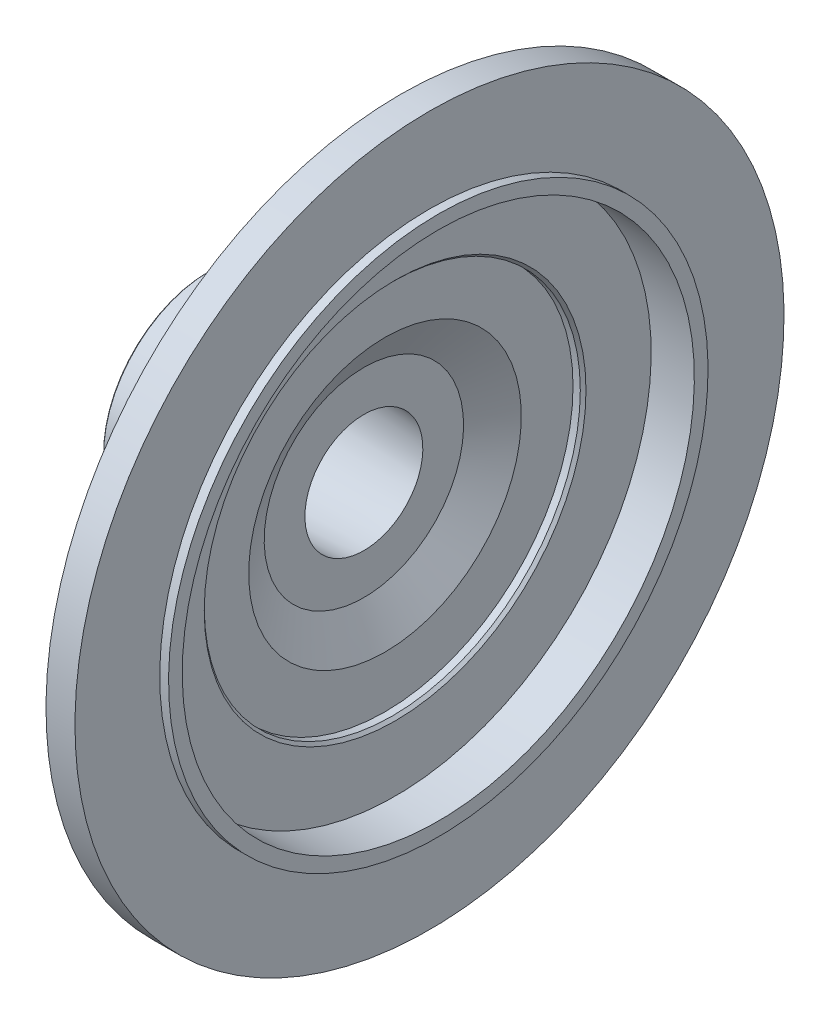
ISO-10303-21;
HEADER;
FILE_DESCRIPTION(('STEP AP214'),'2;1');
FILE_NAME('part.step','',(''),(''),'','','');
FILE_SCHEMA(('AUTOMOTIVE_DESIGN { 1 0 10303 214 1 1 1 1 }'));
ENDSEC;
DATA;
#1=APPLICATION_CONTEXT('core data for automotive mechanical design processes');
#2=APPLICATION_PROTOCOL_DEFINITION('international standard','automotive_design',2000,#1);
#3=PRODUCT_CONTEXT('',#1,'mechanical');
#4=PRODUCT('Part','Part','',(#3));
#5=PRODUCT_RELATED_PRODUCT_CATEGORY('part','',(#4));
#6=PRODUCT_DEFINITION_FORMATION('','',#4);
#7=PRODUCT_DEFINITION_CONTEXT('part definition',#1,'design');
#8=PRODUCT_DEFINITION('design','',#6,#7);
#9=PRODUCT_DEFINITION_SHAPE('','',#8);
#10=(LENGTH_UNIT() NAMED_UNIT(*) SI_UNIT(.MILLI.,.METRE.));
#11=(NAMED_UNIT(*) PLANE_ANGLE_UNIT() SI_UNIT($,.RADIAN.));
#12=(NAMED_UNIT(*) SI_UNIT($,.STERADIAN.) SOLID_ANGLE_UNIT());
#13=UNCERTAINTY_MEASURE_WITH_UNIT(LENGTH_MEASURE(1.E-05),#10,'distance_accuracy_value','');
#14=(GEOMETRIC_REPRESENTATION_CONTEXT(3) GLOBAL_UNCERTAINTY_ASSIGNED_CONTEXT((#13)) GLOBAL_UNIT_ASSIGNED_CONTEXT((#10,
#11,#12)) REPRESENTATION_CONTEXT('',''));
#15=CARTESIAN_POINT('',(0.,0.,0.));
#16=DIRECTION('',(0.,0.,1.));
#17=DIRECTION('',(1.,0.,0.));
#18=AXIS2_PLACEMENT_3D('',#15,#16,#17);
#19=CARTESIAN_POINT('',(-48.0675954825534,0.,0.));
#20=DIRECTION('',(1.,0.,0.));
#21=DIRECTION('',(0.,1.,0.));
#22=AXIS2_PLACEMENT_3D('',#19,#20,#21);
#23=TOROIDAL_SURFACE('',#22,42.45,4.99999999999999);
#24=CARTESIAN_POINT('',(-48.0675954825534,0.,0.));
#25=DIRECTION('',(1.,0.,0.));
#26=DIRECTION('',(0.,1.,0.));
#27=AXIS2_PLACEMENT_3D('',#24,#25,#26);
#28=CIRCLE('',#27,37.45);
#29=CARTESIAN_POINT('',(-48.0675954825534,37.45,0.));
#30=VERTEX_POINT('',#29);
#31=EDGE_CURVE('E109',#30,#30,#28,.T.);
#32=ORIENTED_EDGE('',*,*,#31,.T.);
#33=EDGE_LOOP('',(#32));
#34=FACE_BOUND('',#33,.T.);
#35=CARTESIAN_POINT('',(-43.0675954825534,0.,0.));
#36=DIRECTION('',(1.,0.,0.));
#37=DIRECTION('',(0.,1.,0.));
#38=AXIS2_PLACEMENT_3D('',#35,#36,#37);
#39=CIRCLE('',#38,42.45);
#40=CARTESIAN_POINT('',(-43.0675954825534,42.45,0.));
#41=VERTEX_POINT('',#40);
#42=EDGE_CURVE('E10',#41,#41,#39,.T.);
#43=ORIENTED_EDGE('',*,*,#42,.F.);
#44=EDGE_LOOP('',(#43));
#45=FACE_BOUND('',#44,.T.);
#46=ADVANCED_FACE('F36',(#34,#45),#23,.F.);
#47=CARTESIAN_POINT('',(-43.0675954825534,42.45,0.));
#48=DIRECTION('',(-1.,0.,0.));
#49=DIRECTION('',(0.,-1.,0.));
#50=AXIS2_PLACEMENT_3D('',#47,#48,#49);
#51=PLANE('',#50);
#52=ORIENTED_EDGE('',*,*,#42,.T.);
#53=EDGE_LOOP('',(#52));
#54=FACE_BOUND('',#53,.T.);
#55=CARTESIAN_POINT('',(-43.0675954825534,0.,0.));
#56=DIRECTION('',(1.,0.,0.));
#57=DIRECTION('',(0.,1.,0.));
#58=AXIS2_PLACEMENT_3D('',#55,#56,#57);
#59=CIRCLE('',#58,68.6);
#60=CARTESIAN_POINT('',(-43.0675954825534,68.6,0.));
#61=VERTEX_POINT('',#60);
#62=EDGE_CURVE('E42',#61,#61,#59,.T.);
#63=ORIENTED_EDGE('',*,*,#62,.F.);
#64=EDGE_LOOP('',(#63));
#65=FACE_BOUND('',#64,.T.);
#66=ADVANCED_FACE('F127',(#54,#65),#51,.T.);
#67=CARTESIAN_POINT('',(0.,0.,0.));
#68=DIRECTION('',(1.,0.,0.));
#69=DIRECTION('',(0.,1.,0.));
#70=AXIS2_PLACEMENT_3D('',#67,#68,#69);
#71=CYLINDRICAL_SURFACE('',#70,68.6);
#72=ORIENTED_EDGE('',*,*,#62,.T.);
#73=EDGE_LOOP('',(#72));
#74=FACE_BOUND('',#73,.T.);
#75=CARTESIAN_POINT('',(-35.7675954825534,0.,0.));
#76=DIRECTION('',(1.,0.,0.));
#77=DIRECTION('',(0.,1.,0.));
#78=AXIS2_PLACEMENT_3D('',#75,#76,#77);
#79=CIRCLE('',#78,68.6);
#80=CARTESIAN_POINT('',(-35.7675954825534,68.6,0.));
#81=VERTEX_POINT('',#80);
#82=EDGE_CURVE('E46',#81,#81,#79,.T.);
#83=ORIENTED_EDGE('',*,*,#82,.F.);
#84=EDGE_LOOP('',(#83));
#85=FACE_BOUND('',#84,.T.);
#86=ADVANCED_FACE('F131',(#74,#85),#71,.T.);
#87=CARTESIAN_POINT('',(-35.7675954825534,68.6,0.));
#88=DIRECTION('',(-1.,0.,0.));
#89=DIRECTION('',(0.,-1.,0.));
#90=AXIS2_PLACEMENT_3D('',#87,#88,#89);
#91=PLANE('',#90);
#92=ORIENTED_EDGE('',*,*,#82,.T.);
#93=EDGE_LOOP('',(#92));
#94=FACE_BOUND('',#93,.T.);
#95=CARTESIAN_POINT('',(-35.7675954825534,0.,0.));
#96=DIRECTION('',(1.,0.,0.));
#97=DIRECTION('',(0.,1.,0.));
#98=AXIS2_PLACEMENT_3D('',#95,#96,#97);
#99=CIRCLE('',#98,95.25);
#100=CARTESIAN_POINT('',(-35.7675954825534,95.25,0.));
#101=VERTEX_POINT('',#100);
#102=EDGE_CURVE('E50',#101,#101,#99,.T.);
#103=ORIENTED_EDGE('',*,*,#102,.F.);
#104=EDGE_LOOP('',(#103));
#105=FACE_BOUND('',#104,.T.);
#106=ADVANCED_FACE('F135',(#94,#105),#91,.T.);
#107=CARTESIAN_POINT('',(-25.9175954825534,0.,0.));
#108=DIRECTION('',(1.,0.,0.));
#109=DIRECTION('',(0.,1.,0.));
#110=AXIS2_PLACEMENT_3D('',#107,#108,#109);
#111=CONICAL_SURFACE('',#110,105.1,0.785398163397448);
#112=ORIENTED_EDGE('',*,*,#102,.T.);
#113=EDGE_LOOP('',(#112));
#114=FACE_BOUND('',#113,.T.);
#115=CARTESIAN_POINT('',(-25.9175954825534,0.,0.));
#116=DIRECTION('',(1.,0.,0.));
#117=DIRECTION('',(0.,1.,0.));
#118=AXIS2_PLACEMENT_3D('',#115,#116,#117);
#119=CIRCLE('',#118,105.1);
#120=CARTESIAN_POINT('',(-25.9175954825534,105.1,0.));
#121=VERTEX_POINT('',#120);
#122=EDGE_CURVE('E55',#121,#121,#119,.T.);
#123=ORIENTED_EDGE('',*,*,#122,.F.);
#124=EDGE_LOOP('',(#123));
#125=FACE_BOUND('',#124,.T.);
#126=ADVANCED_FACE('F141',(#114,#125),#111,.T.);
#127=CARTESIAN_POINT('',(0.,0.,0.));
#128=DIRECTION('',(1.,0.,0.));
#129=DIRECTION('',(0.,1.,0.));
#130=AXIS2_PLACEMENT_3D('',#127,#128,#129);
#131=CYLINDRICAL_SURFACE('',#130,105.1);
#132=ORIENTED_EDGE('',*,*,#122,.T.);
#133=EDGE_LOOP('',(#132));
#134=FACE_BOUND('',#133,.T.);
#135=CARTESIAN_POINT('',(-20.7675954825534,0.,0.));
#136=DIRECTION('',(1.,0.,0.));
#137=DIRECTION('',(0.,1.,0.));
#138=AXIS2_PLACEMENT_3D('',#135,#136,#137);
#139=CIRCLE('',#138,105.1);
#140=CARTESIAN_POINT('',(-20.7675954825534,105.1,0.));
#141=VERTEX_POINT('',#140);
#142=EDGE_CURVE('E58',#141,#141,#139,.T.);
#143=ORIENTED_EDGE('',*,*,#142,.F.);
#144=EDGE_LOOP('',(#143));
#145=FACE_BOUND('',#144,.T.);
#146=ADVANCED_FACE('F145',(#134,#145),#131,.T.);
#147=CARTESIAN_POINT('',(-20.7675954825534,105.1,0.));
#148=DIRECTION('',(-1.,0.,0.));
#149=DIRECTION('',(0.,-1.,0.));
#150=AXIS2_PLACEMENT_3D('',#147,#148,#149);
#151=PLANE('',#150);
#152=ORIENTED_EDGE('',*,*,#142,.T.);
#153=EDGE_LOOP('',(#152));
#154=FACE_BOUND('',#153,.T.);
#155=CARTESIAN_POINT('',(-20.7675954825534,0.,0.));
#156=DIRECTION('',(1.,0.,0.));
#157=DIRECTION('',(0.,1.,0.));
#158=AXIS2_PLACEMENT_3D('',#155,#156,#157);
#159=CIRCLE('',#158,124.82);
#160=CARTESIAN_POINT('',(-20.7675954825534,124.82,0.));
#161=VERTEX_POINT('',#160);
#162=EDGE_CURVE('E61',#161,#161,#159,.T.);
#163=ORIENTED_EDGE('',*,*,#162,.F.);
#164=EDGE_LOOP('',(#163));
#165=FACE_BOUND('',#164,.T.);
#166=ADVANCED_FACE('F149',(#154,#165),#151,.T.);
#167=CARTESIAN_POINT('',(0.,0.,0.));
#168=DIRECTION('',(1.,0.,0.));
#169=DIRECTION('',(0.,1.,0.));
#170=AXIS2_PLACEMENT_3D('',#167,#168,#169);
#171=CYLINDRICAL_SURFACE('',#170,124.82);
#172=ORIENTED_EDGE('',*,*,#162,.T.);
#173=EDGE_LOOP('',(#172));
#174=FACE_BOUND('',#173,.T.);
#175=CARTESIAN_POINT('',(-10.5675954825534,0.,0.));
#176=DIRECTION('',(1.,0.,0.));
#177=DIRECTION('',(0.,1.,0.));
#178=AXIS2_PLACEMENT_3D('',#175,#176,#177);
#179=CIRCLE('',#178,124.82);
#180=CARTESIAN_POINT('',(-10.5675954825534,124.82,0.));
#181=VERTEX_POINT('',#180);
#182=EDGE_CURVE('E64',#181,#181,#179,.T.);
#183=ORIENTED_EDGE('',*,*,#182,.F.);
#184=EDGE_LOOP('',(#183));
#185=FACE_BOUND('',#184,.T.);
#186=ADVANCED_FACE('F153',(#174,#185),#171,.T.);
#187=CARTESIAN_POINT('',(-10.5675954825534,124.82,0.));
#188=DIRECTION('',(1.,0.,0.));
#189=DIRECTION('',(0.,1.,0.));
#190=AXIS2_PLACEMENT_3D('',#187,#188,#189);
#191=PLANE('',#190);
#192=ORIENTED_EDGE('',*,*,#182,.T.);
#193=EDGE_LOOP('',(#192));
#194=FACE_BOUND('',#193,.T.);
#195=CARTESIAN_POINT('',(-10.5675954825534,0.,0.));
#196=DIRECTION('',(1.,0.,0.));
#197=DIRECTION('',(0.,1.,0.));
#198=AXIS2_PLACEMENT_3D('',#195,#196,#197);
#199=CIRCLE('',#198,94.97);
#200=CARTESIAN_POINT('',(-10.5675954825534,94.97,0.));
#201=VERTEX_POINT('',#200);
#202=EDGE_CURVE('E67',#201,#201,#199,.T.);
#203=ORIENTED_EDGE('',*,*,#202,.F.);
#204=EDGE_LOOP('',(#203));
#205=FACE_BOUND('',#204,.T.);
#206=ADVANCED_FACE('F157',(#194,#205),#191,.T.);
#207=CARTESIAN_POINT('',(0.,0.,0.));
#208=DIRECTION('',(1.,0.,0.));
#209=DIRECTION('',(0.,1.,0.));
#210=AXIS2_PLACEMENT_3D('',#207,#208,#209);
#211=CYLINDRICAL_SURFACE('',#210,94.97);
#212=ORIENTED_EDGE('',*,*,#202,.T.);
#213=EDGE_LOOP('',(#212));
#214=FACE_BOUND('',#213,.T.);
#215=CARTESIAN_POINT('',(-7.46759548255339,0.,0.));
#216=DIRECTION('',(1.,0.,0.));
#217=DIRECTION('',(0.,1.,0.));
#218=AXIS2_PLACEMENT_3D('',#215,#216,#217);
#219=CIRCLE('',#218,94.97);
#220=CARTESIAN_POINT('',(-7.4675954825534,94.97,0.));
#221=VERTEX_POINT('',#220);
#222=EDGE_CURVE('E70',#221,#221,#219,.T.);
#223=ORIENTED_EDGE('',*,*,#222,.F.);
#224=EDGE_LOOP('',(#223));
#225=FACE_BOUND('',#224,.T.);
#226=ADVANCED_FACE('F161',(#214,#225),#211,.T.);
#227=CARTESIAN_POINT('',(-7.4675954825534,94.97,0.));
#228=DIRECTION('',(1.,0.,0.));
#229=DIRECTION('',(0.,1.,0.));
#230=AXIS2_PLACEMENT_3D('',#227,#228,#229);
#231=PLANE('',#230);
#232=ORIENTED_EDGE('',*,*,#222,.T.);
#233=EDGE_LOOP('',(#232));
#234=FACE_BOUND('',#233,.T.);
#235=CARTESIAN_POINT('',(-7.46759548255339,0.,0.));
#236=DIRECTION('',(1.,0.,0.));
#237=DIRECTION('',(0.,1.,0.));
#238=AXIS2_PLACEMENT_3D('',#235,#236,#237);
#239=CIRCLE('',#238,90.15);
#240=CARTESIAN_POINT('',(-7.4675954825534,90.15,0.));
#241=VERTEX_POINT('',#240);
#242=EDGE_CURVE('E73',#241,#241,#239,.T.);
#243=ORIENTED_EDGE('',*,*,#242,.F.);
#244=EDGE_LOOP('',(#243));
#245=FACE_BOUND('',#244,.T.);
#246=ADVANCED_FACE('F165',(#234,#245),#231,.T.);
#247=CARTESIAN_POINT('',(0.,0.,0.));
#248=DIRECTION('',(1.,0.,0.));
#249=DIRECTION('',(0.,1.,0.));
#250=AXIS2_PLACEMENT_3D('',#247,#248,#249);
#251=CYLINDRICAL_SURFACE('',#250,90.15);
#252=ORIENTED_EDGE('',*,*,#242,.T.);
#253=EDGE_LOOP('',(#252));
#254=FACE_BOUND('',#253,.T.);
#255=CARTESIAN_POINT('',(-22.6675954825534,0.,0.));
#256=DIRECTION('',(1.,0.,0.));
#257=DIRECTION('',(0.,1.,0.));
#258=AXIS2_PLACEMENT_3D('',#255,#256,#257);
#259=CIRCLE('',#258,90.15);
#260=CARTESIAN_POINT('',(-22.6675954825534,90.15,0.));
#261=VERTEX_POINT('',#260);
#262=EDGE_CURVE('E76',#261,#261,#259,.T.);
#263=ORIENTED_EDGE('',*,*,#262,.F.);
#264=EDGE_LOOP('',(#263));
#265=FACE_BOUND('',#264,.T.);
#266=ADVANCED_FACE('F169',(#254,#265),#251,.F.);
#267=CARTESIAN_POINT('',(-22.6675954825534,90.15,0.));
#268=DIRECTION('',(1.,0.,0.));
#269=DIRECTION('',(0.,1.,0.));
#270=AXIS2_PLACEMENT_3D('',#267,#268,#269);
#271=PLANE('',#270);
#272=ORIENTED_EDGE('',*,*,#262,.T.);
#273=EDGE_LOOP('',(#272));
#274=FACE_BOUND('',#273,.T.);
#275=CARTESIAN_POINT('',(-22.6675954825534,0.,0.));
#276=DIRECTION('',(1.,0.,0.));
#277=DIRECTION('',(0.,1.,0.));
#278=AXIS2_PLACEMENT_3D('',#275,#276,#277);
#279=CIRCLE('',#278,67.2);
#280=CARTESIAN_POINT('',(-22.6675954825534,67.2,0.));
#281=VERTEX_POINT('',#280);
#282=EDGE_CURVE('E79',#281,#281,#279,.T.);
#283=ORIENTED_EDGE('',*,*,#282,.F.);
#284=EDGE_LOOP('',(#283));
#285=FACE_BOUND('',#284,.T.);
#286=ADVANCED_FACE('F173',(#274,#285),#271,.T.);
#287=CARTESIAN_POINT('',(-23.6675954825534,0.,0.));
#288=DIRECTION('',(1.,0.,0.));
#289=DIRECTION('',(0.,1.,0.));
#290=AXIS2_PLACEMENT_3D('',#287,#288,#289);
#291=CONICAL_SURFACE('',#290,66.2,0.785398163397448);
#292=ORIENTED_EDGE('',*,*,#282,.T.);
#293=EDGE_LOOP('',(#292));
#294=FACE_BOUND('',#293,.T.);
#295=CARTESIAN_POINT('',(-23.6675954825534,0.,0.));
#296=DIRECTION('',(1.,0.,0.));
#297=DIRECTION('',(0.,1.,0.));
#298=AXIS2_PLACEMENT_3D('',#295,#296,#297);
#299=CIRCLE('',#298,66.2);
#300=CARTESIAN_POINT('',(-23.6675954825534,66.2,0.));
#301=VERTEX_POINT('',#300);
#302=EDGE_CURVE('E82',#301,#301,#299,.T.);
#303=ORIENTED_EDGE('',*,*,#302,.F.);
#304=EDGE_LOOP('',(#303));
#305=FACE_BOUND('',#304,.T.);
#306=ADVANCED_FACE('F177',(#294,#305),#291,.F.);
#307=CARTESIAN_POINT('',(0.,0.,0.));
#308=DIRECTION('',(1.,0.,0.));
#309=DIRECTION('',(0.,1.,0.));
#310=AXIS2_PLACEMENT_3D('',#307,#308,#309);
#311=CYLINDRICAL_SURFACE('',#310,66.2);
#312=ORIENTED_EDGE('',*,*,#302,.T.);
#313=EDGE_LOOP('',(#312));
#314=FACE_BOUND('',#313,.T.);
#315=CARTESIAN_POINT('',(-26.2275954825534,0.,0.));
#316=DIRECTION('',(1.,0.,0.));
#317=DIRECTION('',(0.,1.,0.));
#318=AXIS2_PLACEMENT_3D('',#315,#316,#317);
#319=CIRCLE('',#318,66.2);
#320=CARTESIAN_POINT('',(-26.2275954825534,66.2,0.));
#321=VERTEX_POINT('',#320);
#322=EDGE_CURVE('E85',#321,#321,#319,.T.);
#323=ORIENTED_EDGE('',*,*,#322,.F.);
#324=EDGE_LOOP('',(#323));
#325=FACE_BOUND('',#324,.T.);
#326=ADVANCED_FACE('F181',(#314,#325),#311,.F.);
#327=CARTESIAN_POINT('',(-26.2275954825534,66.2,0.));
#328=DIRECTION('',(1.,0.,0.));
#329=DIRECTION('',(0.,1.,0.));
#330=AXIS2_PLACEMENT_3D('',#327,#328,#329);
#331=PLANE('',#330);
#332=ORIENTED_EDGE('',*,*,#322,.T.);
#333=EDGE_LOOP('',(#332));
#334=FACE_BOUND('',#333,.T.);
#335=CARTESIAN_POINT('',(-26.2275954825534,0.,0.));
#336=DIRECTION('',(1.,0.,0.));
#337=DIRECTION('',(0.,1.,0.));
#338=AXIS2_PLACEMENT_3D('',#335,#336,#337);
#339=CIRCLE('',#338,47.99);
#340=CARTESIAN_POINT('',(-26.2275954825534,47.99,0.));
#341=VERTEX_POINT('',#340);
#342=EDGE_CURVE('E88',#341,#341,#339,.T.);
#343=ORIENTED_EDGE('',*,*,#342,.F.);
#344=EDGE_LOOP('',(#343));
#345=FACE_BOUND('',#344,.T.);
#346=ADVANCED_FACE('F185',(#334,#345),#331,.T.);
#347=CARTESIAN_POINT('',(-33.6675954825534,0.,0.));
#348=DIRECTION('',(1.,0.,0.));
#349=DIRECTION('',(0.,1.,0.));
#350=AXIS2_PLACEMENT_3D('',#347,#348,#349);
#351=CONICAL_SURFACE('',#350,35.1035419916876,1.0471975511966);
#352=ORIENTED_EDGE('',*,*,#342,.T.);
#353=EDGE_LOOP('',(#352));
#354=FACE_BOUND('',#353,.T.);
#355=CARTESIAN_POINT('',(-33.6675954825534,0.,0.));
#356=DIRECTION('',(1.,0.,0.));
#357=DIRECTION('',(0.,1.,0.));
#358=AXIS2_PLACEMENT_3D('',#355,#356,#357);
#359=CIRCLE('',#358,35.1035419916876);
#360=CARTESIAN_POINT('',(-33.6675954825534,35.1035419916876,0.));
#361=VERTEX_POINT('',#360);
#362=EDGE_CURVE('E91',#361,#361,#359,.T.);
#363=ORIENTED_EDGE('',*,*,#362,.F.);
#364=EDGE_LOOP('',(#363));
#365=FACE_BOUND('',#364,.T.);
#366=ADVANCED_FACE('F189',(#354,#365),#351,.F.);
#367=CARTESIAN_POINT('',(-33.6675954825534,35.1035419916876,0.));
#368=DIRECTION('',(1.,0.,0.));
#369=DIRECTION('',(0.,1.,0.));
#370=AXIS2_PLACEMENT_3D('',#367,#368,#369);
#371=PLANE('',#370);
#372=ORIENTED_EDGE('',*,*,#362,.T.);
#373=EDGE_LOOP('',(#372));
#374=FACE_BOUND('',#373,.T.);
#375=CARTESIAN_POINT('',(-33.6675954825534,0.,0.));
#376=DIRECTION('',(1.,0.,0.));
#377=DIRECTION('',(0.,1.,0.));
#378=AXIS2_PLACEMENT_3D('',#375,#376,#377);
#379=CIRCLE('',#378,20.76);
#380=CARTESIAN_POINT('',(-33.6675954825534,20.76,0.));
#381=VERTEX_POINT('',#380);
#382=EDGE_CURVE('E94',#381,#381,#379,.T.);
#383=ORIENTED_EDGE('',*,*,#382,.F.);
#384=EDGE_LOOP('',(#383));
#385=FACE_BOUND('',#384,.T.);
#386=ADVANCED_FACE('F193',(#374,#385),#371,.T.);
#387=CARTESIAN_POINT('',(-86.8702199167567,0.,0.));
#388=DIRECTION('',(-1.,0.,0.));
#389=DIRECTION('',(0.,-1.,0.));
#390=AXIS2_PLACEMENT_3D('',#387,#388,#389);
#391=CONICAL_SURFACE('',#390,23.9113071876932,0.059163049904563);
#392=ORIENTED_EDGE('',*,*,#382,.T.);
#393=EDGE_LOOP('',(#392));
#394=FACE_BOUND('',#393,.T.);
#395=CARTESIAN_POINT('',(-86.8702199167567,0.,0.));
#396=DIRECTION('',(1.,0.,0.));
#397=DIRECTION('',(0.,1.,0.));
#398=AXIS2_PLACEMENT_3D('',#395,#396,#397);
#399=CIRCLE('',#398,23.9113071876932);
#400=CARTESIAN_POINT('',(-86.8702199167567,23.9113071876932,0.));
#401=VERTEX_POINT('',#400);
#402=EDGE_CURVE('E97',#401,#401,#399,.T.);
#403=ORIENTED_EDGE('',*,*,#402,.F.);
#404=EDGE_LOOP('',(#403));
#405=FACE_BOUND('',#404,.T.);
#406=ADVANCED_FACE('F197',(#394,#405),#391,.F.);
#407=CARTESIAN_POINT('',(-88.3675954825534,0.,0.));
#408=DIRECTION('',(-1.,0.,0.));
#409=DIRECTION('',(0.,-1.,0.));
#410=AXIS2_PLACEMENT_3D('',#407,#408,#409);
#411=CONICAL_SURFACE('',#410,25.5972368472786,0.844561213302009);
#412=ORIENTED_EDGE('',*,*,#402,.T.);
#413=EDGE_LOOP('',(#412));
#414=FACE_BOUND('',#413,.T.);
#415=CARTESIAN_POINT('',(-88.3675954825534,0.,0.));
#416=DIRECTION('',(1.,0.,0.));
#417=DIRECTION('',(0.,1.,0.));
#418=AXIS2_PLACEMENT_3D('',#415,#416,#417);
#419=CIRCLE('',#418,25.5972368472786);
#420=CARTESIAN_POINT('',(-88.3675954825534,25.5972368472786,0.));
#421=VERTEX_POINT('',#420);
#422=EDGE_CURVE('E100',#421,#421,#419,.T.);
#423=ORIENTED_EDGE('',*,*,#422,.F.);
#424=EDGE_LOOP('',(#423));
#425=FACE_BOUND('',#424,.T.);
#426=ADVANCED_FACE('F201',(#414,#425),#411,.F.);
#427=CARTESIAN_POINT('',(-88.3675954825534,25.5972368472786,0.));
#428=DIRECTION('',(-1.,0.,0.));
#429=DIRECTION('',(0.,-1.,0.));
#430=AXIS2_PLACEMENT_3D('',#427,#428,#429);
#431=PLANE('',#430);
#432=ORIENTED_EDGE('',*,*,#422,.T.);
#433=EDGE_LOOP('',(#432));
#434=FACE_BOUND('',#433,.T.);
#435=CARTESIAN_POINT('',(-88.3675954825534,0.,0.));
#436=DIRECTION('',(1.,0.,0.));
#437=DIRECTION('',(0.,1.,0.));
#438=AXIS2_PLACEMENT_3D('',#435,#436,#437);
#439=CIRCLE('',#438,36.95);
#440=CARTESIAN_POINT('',(-88.3675954825534,36.95,0.));
#441=VERTEX_POINT('',#440);
#442=EDGE_CURVE('E103',#441,#441,#439,.T.);
#443=ORIENTED_EDGE('',*,*,#442,.F.);
#444=EDGE_LOOP('',(#443));
#445=FACE_BOUND('',#444,.T.);
#446=ADVANCED_FACE('F123',(#434,#445),#431,.T.);
#447=CARTESIAN_POINT('',(-87.8675954825534,0.,0.));
#448=DIRECTION('',(1.,0.,0.));
#449=DIRECTION('',(0.,1.,0.));
#450=AXIS2_PLACEMENT_3D('',#447,#448,#449);
#451=CONICAL_SURFACE('',#450,37.45,0.785398163397448);
#452=ORIENTED_EDGE('',*,*,#442,.T.);
#453=EDGE_LOOP('',(#452));
#454=FACE_BOUND('',#453,.T.);
#455=CARTESIAN_POINT('',(-87.8675954825534,0.,0.));
#456=DIRECTION('',(1.,0.,0.));
#457=DIRECTION('',(0.,1.,0.));
#458=AXIS2_PLACEMENT_3D('',#455,#456,#457);
#459=CIRCLE('',#458,37.45);
#460=CARTESIAN_POINT('',(-87.8675954825534,37.45,0.));
#461=VERTEX_POINT('',#460);
#462=EDGE_CURVE('E106',#461,#461,#459,.T.);
#463=ORIENTED_EDGE('',*,*,#462,.F.);
#464=EDGE_LOOP('',(#463));
#465=FACE_BOUND('',#464,.T.);
#466=ADVANCED_FACE('F117',(#454,#465),#451,.T.);
#467=CARTESIAN_POINT('',(0.,0.,0.));
#468=DIRECTION('',(1.,0.,0.));
#469=DIRECTION('',(0.,1.,0.));
#470=AXIS2_PLACEMENT_3D('',#467,#468,#469);
#471=CYLINDRICAL_SURFACE('',#470,37.45);
#472=ORIENTED_EDGE('',*,*,#462,.T.);
#473=EDGE_LOOP('',(#472));
#474=FACE_BOUND('',#473,.T.);
#475=ORIENTED_EDGE('',*,*,#31,.F.);
#476=EDGE_LOOP('',(#475));
#477=FACE_BOUND('',#476,.T.);
#478=ADVANCED_FACE('F115',(#474,#477),#471,.T.);
#479=CLOSED_SHELL('',(#46,#66,#86,#106,#126,#146,#166,#186,#206,#226,#246,#266,#286,#306,#326,
#346,#366,#386,#406,#426,#446,#466,#478));
#480=MANIFOLD_SOLID_BREP('B2',#479);
#481=ADVANCED_BREP_SHAPE_REPRESENTATION('',(#18,#480),#14);
#482=SHAPE_DEFINITION_REPRESENTATION(#9,#481);
ENDSEC;
END-ISO-10303-21;
